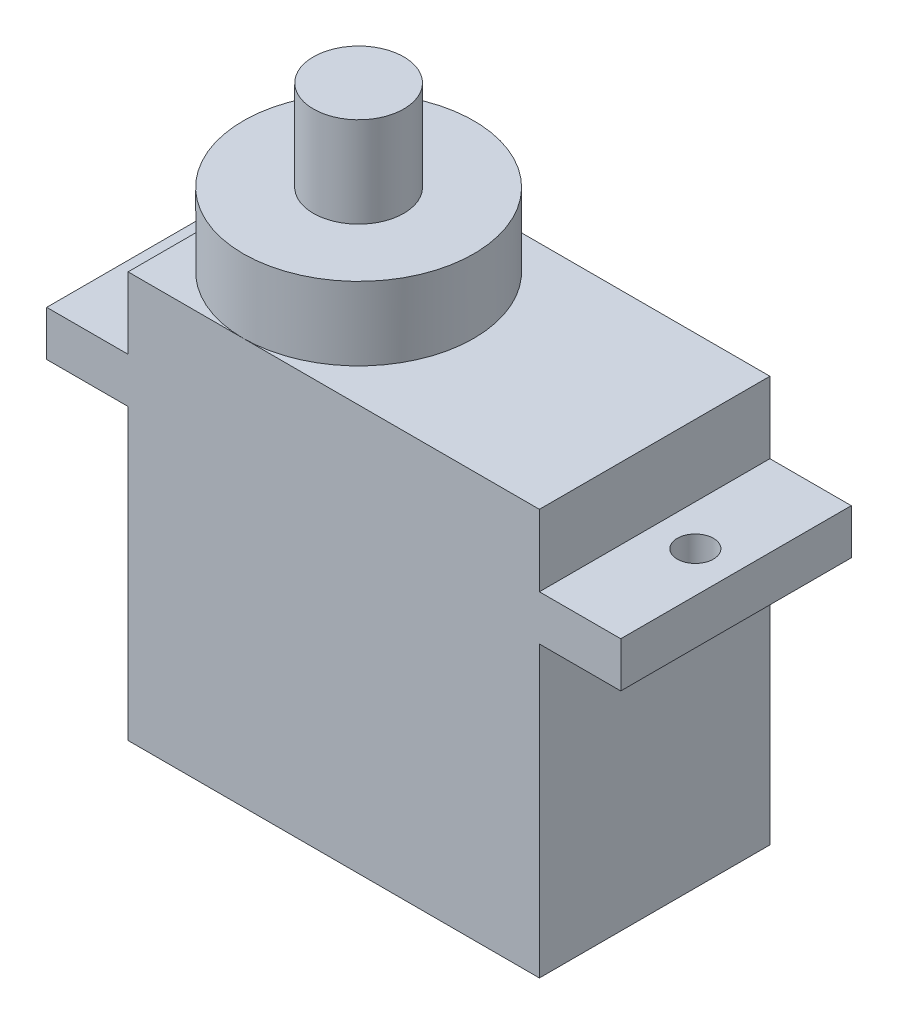
ISO-10303-21;
HEADER;
FILE_DESCRIPTION(('STEP AP214'),'2;1');
FILE_NAME('part.step','',(''),(''),'','','');
FILE_SCHEMA(('AUTOMOTIVE_DESIGN { 1 0 10303 214 1 1 1 1 }'));
ENDSEC;
DATA;
#1=APPLICATION_CONTEXT('core data for automotive mechanical design processes');
#2=APPLICATION_PROTOCOL_DEFINITION('international standard','automotive_design',2000,#1);
#3=PRODUCT_CONTEXT('',#1,'mechanical');
#4=PRODUCT('Part','Part','',(#3));
#5=PRODUCT_RELATED_PRODUCT_CATEGORY('part','',(#4));
#6=PRODUCT_DEFINITION_FORMATION('','',#4);
#7=PRODUCT_DEFINITION_CONTEXT('part definition',#1,'design');
#8=PRODUCT_DEFINITION('design','',#6,#7);
#9=PRODUCT_DEFINITION_SHAPE('','',#8);
#10=(LENGTH_UNIT() NAMED_UNIT(*) SI_UNIT(.MILLI.,.METRE.));
#11=(NAMED_UNIT(*) PLANE_ANGLE_UNIT() SI_UNIT($,.RADIAN.));
#12=(NAMED_UNIT(*) SI_UNIT($,.STERADIAN.) SOLID_ANGLE_UNIT());
#13=UNCERTAINTY_MEASURE_WITH_UNIT(LENGTH_MEASURE(1.E-05),#10,'distance_accuracy_value','');
#14=(GEOMETRIC_REPRESENTATION_CONTEXT(3) GLOBAL_UNCERTAINTY_ASSIGNED_CONTEXT((#13)) GLOBAL_UNIT_ASSIGNED_CONTEXT((#10,
#11,#12)) REPRESENTATION_CONTEXT('',''));
#15=CARTESIAN_POINT('',(0.,0.,0.));
#16=DIRECTION('',(0.,0.,1.));
#17=DIRECTION('',(1.,0.,0.));
#18=AXIS2_PLACEMENT_3D('',#15,#16,#17);
#19=CARTESIAN_POINT('',(-7.89586466165413,11.225,12.75));
#20=DIRECTION('',(0.,-1.,0.));
#21=DIRECTION('',(0.,0.,-1.));
#22=AXIS2_PLACEMENT_3D('',#19,#20,#21);
#23=PLANE('',#22);
#24=CARTESIAN_POINT('',(-1.52086466165413,11.225,6.375));
#25=DIRECTION('',(0.,1.,0.));
#26=DIRECTION('',(0.,0.,1.));
#27=AXIS2_PLACEMENT_3D('',#24,#25,#26);
#28=CIRCLE('',#27,6.375);
#29=CARTESIAN_POINT('',(-1.52086466165413,11.225,12.75));
#30=VERTEX_POINT('',#29);
#31=CARTESIAN_POINT('',(-1.52086466165413,11.225,0.));
#32=VERTEX_POINT('',#31);
#33=EDGE_CURVE('E154',#30,#32,#28,.T.);
#34=ORIENTED_EDGE('',*,*,#33,.F.);
#35=DIRECTION('',(-1.,0.,0.));
#36=VECTOR('',#35,1.);
#37=CARTESIAN_POINT('',(-7.89586466165413,11.225,12.75));
#38=LINE('',#37,#36);
#39=CARTESIAN_POINT('',(14.8541353383459,11.225,12.75));
#40=VERTEX_POINT('',#39);
#41=EDGE_CURVE('E134',#40,#30,#38,.T.);
#42=ORIENTED_EDGE('',*,*,#41,.F.);
#43=DIRECTION('',(0.,0.,-1.));
#44=VECTOR('',#43,1.);
#45=CARTESIAN_POINT('',(14.8541353383459,11.225,12.75));
#46=LINE('',#45,#44);
#47=CARTESIAN_POINT('',(14.8541353383459,11.225,0.));
#48=VERTEX_POINT('',#47);
#49=EDGE_CURVE('E37',#40,#48,#46,.T.);
#50=ORIENTED_EDGE('',*,*,#49,.T.);
#51=DIRECTION('',(-1.,0.,0.));
#52=VECTOR('',#51,1.);
#53=CARTESIAN_POINT('',(-7.89586466165413,11.225,0.));
#54=LINE('',#53,#52);
#55=EDGE_CURVE('E156',#48,#32,#54,.T.);
#56=ORIENTED_EDGE('',*,*,#55,.T.);
#57=EDGE_LOOP('',(#34,#42,#50,#56));
#58=FACE_BOUND('',#57,.T.);
#59=ADVANCED_FACE('F33',(#58),#23,.F.);
#60=CARTESIAN_POINT('',(-7.89586466165413,11.225,6.375));
#61=VERTEX_POINT('',#60);
#62=EDGE_CURVE('E42',#32,#61,#28,.T.);
#63=ORIENTED_EDGE('',*,*,#62,.F.);
#64=CARTESIAN_POINT('',(-7.89586466165413,11.225,0.));
#65=VERTEX_POINT('',#64);
#66=EDGE_CURVE('E238',#32,#65,#54,.T.);
#67=ORIENTED_EDGE('',*,*,#66,.T.);
#68=DIRECTION('',(0.,0.,-1.));
#69=VECTOR('',#68,1.);
#70=CARTESIAN_POINT('',(-7.89586466165413,11.225,12.75));
#71=LINE('',#70,#69);
#72=EDGE_CURVE('E249',#61,#65,#71,.T.);
#73=ORIENTED_EDGE('',*,*,#72,.F.);
#74=EDGE_LOOP('',(#63,#67,#73));
#75=FACE_BOUND('',#74,.T.);
#76=ADVANCED_FACE('F253',(#75),#23,.F.);
#77=CARTESIAN_POINT('',(-7.89586466165413,-11.225,12.75));
#78=DIRECTION('',(1.,0.,0.));
#79=DIRECTION('',(0.,0.,-1.));
#80=AXIS2_PLACEMENT_3D('',#77,#78,#79);
#81=PLANE('',#80);
#82=DIRECTION('',(0.,0.,-1.));
#83=VECTOR('',#82,1.);
#84=CARTESIAN_POINT('',(-7.89586466165413,7.275,0.));
#85=LINE('',#84,#83);
#86=CARTESIAN_POINT('',(-7.89586466165413,7.275,12.75));
#87=VERTEX_POINT('',#86);
#88=CARTESIAN_POINT('',(-7.89586466165413,7.275,0.));
#89=VERTEX_POINT('',#88);
#90=EDGE_CURVE('E181',#87,#89,#85,.T.);
#91=ORIENTED_EDGE('',*,*,#90,.F.);
#92=DIRECTION('',(0.,-1.,0.));
#93=VECTOR('',#92,1.);
#94=CARTESIAN_POINT('',(-7.89586466165413,-11.225,12.75));
#95=LINE('',#94,#93);
#96=CARTESIAN_POINT('',(-7.89586466165413,11.225,12.75));
#97=VERTEX_POINT('',#96);
#98=EDGE_CURVE('E231',#97,#87,#95,.T.);
#99=ORIENTED_EDGE('',*,*,#98,.F.);
#100=EDGE_CURVE('E149',#97,#61,#71,.T.);
#101=ORIENTED_EDGE('',*,*,#100,.T.);
#102=ORIENTED_EDGE('',*,*,#72,.T.);
#103=DIRECTION('',(0.,-1.,0.));
#104=VECTOR('',#103,1.);
#105=CARTESIAN_POINT('',(-7.89586466165413,-11.225,0.));
#106=LINE('',#105,#104);
#107=EDGE_CURVE('E241',#65,#89,#106,.T.);
#108=ORIENTED_EDGE('',*,*,#107,.T.);
#109=EDGE_LOOP('',(#91,#99,#101,#102,#108));
#110=FACE_BOUND('',#109,.T.);
#111=ADVANCED_FACE('F251',(#110),#81,.F.);
#112=DIRECTION('',(0.,0.,1.));
#113=VECTOR('',#112,1.);
#114=CARTESIAN_POINT('',(-7.89586466165413,4.775,0.));
#115=LINE('',#114,#113);
#116=CARTESIAN_POINT('',(-7.89586466165413,4.775,0.));
#117=VERTEX_POINT('',#116);
#118=CARTESIAN_POINT('',(-7.89586466165413,4.775,12.75));
#119=VERTEX_POINT('',#118);
#120=EDGE_CURVE('E174',#117,#119,#115,.T.);
#121=ORIENTED_EDGE('',*,*,#120,.F.);
#122=CARTESIAN_POINT('',(-7.89586466165413,-11.225,0.));
#123=VERTEX_POINT('',#122);
#124=EDGE_CURVE('E240',#117,#123,#106,.T.);
#125=ORIENTED_EDGE('',*,*,#124,.T.);
#126=DIRECTION('',(0.,0.,-1.));
#127=VECTOR('',#126,1.);
#128=CARTESIAN_POINT('',(-7.89586466165413,-11.225,12.75));
#129=LINE('',#128,#127);
#130=CARTESIAN_POINT('',(-7.89586466165413,-11.225,12.75));
#131=VERTEX_POINT('',#130);
#132=EDGE_CURVE('E247',#131,#123,#129,.T.);
#133=ORIENTED_EDGE('',*,*,#132,.F.);
#134=EDGE_CURVE('E145',#119,#131,#95,.T.);
#135=ORIENTED_EDGE('',*,*,#134,.F.);
#136=EDGE_LOOP('',(#121,#125,#133,#135));
#137=FACE_BOUND('',#136,.T.);
#138=ADVANCED_FACE('F272',(#137),#81,.F.);
#139=CARTESIAN_POINT('',(14.8541353383459,-11.225,12.75));
#140=DIRECTION('',(-1.,0.,0.));
#141=DIRECTION('',(0.,0.,1.));
#142=AXIS2_PLACEMENT_3D('',#139,#140,#141);
#143=PLANE('',#142);
#144=DIRECTION('',(0.,0.,1.));
#145=VECTOR('',#144,1.);
#146=CARTESIAN_POINT('',(14.8541353383459,7.275,12.75));
#147=LINE('',#146,#145);
#148=CARTESIAN_POINT('',(14.8541353383459,7.275,0.));
#149=VERTEX_POINT('',#148);
#150=CARTESIAN_POINT('',(14.8541353383459,7.275,12.75));
#151=VERTEX_POINT('',#150);
#152=EDGE_CURVE('E208',#149,#151,#147,.T.);
#153=ORIENTED_EDGE('',*,*,#152,.F.);
#154=DIRECTION('',(0.,1.,0.));
#155=VECTOR('',#154,1.);
#156=CARTESIAN_POINT('',(14.8541353383459,-11.225,0.));
#157=LINE('',#156,#155);
#158=EDGE_CURVE('E229',#149,#48,#157,.T.);
#159=ORIENTED_EDGE('',*,*,#158,.T.);
#160=ORIENTED_EDGE('',*,*,#49,.F.);
#161=DIRECTION('',(0.,1.,0.));
#162=VECTOR('',#161,1.);
#163=CARTESIAN_POINT('',(14.8541353383459,-11.225,12.75));
#164=LINE('',#163,#162);
#165=EDGE_CURVE('E140',#151,#40,#164,.T.);
#166=ORIENTED_EDGE('',*,*,#165,.F.);
#167=EDGE_LOOP('',(#153,#159,#160,#166));
#168=FACE_BOUND('',#167,.T.);
#169=ADVANCED_FACE('F35',(#168),#143,.F.);
#170=DIRECTION('',(0.,0.,-1.));
#171=VECTOR('',#170,1.);
#172=CARTESIAN_POINT('',(14.8541353383459,4.775,12.75));
#173=LINE('',#172,#171);
#174=CARTESIAN_POINT('',(14.8541353383459,4.775,12.75));
#175=VERTEX_POINT('',#174);
#176=CARTESIAN_POINT('',(14.8541353383459,4.775,0.));
#177=VERTEX_POINT('',#176);
#178=EDGE_CURVE('E203',#175,#177,#173,.T.);
#179=ORIENTED_EDGE('',*,*,#178,.F.);
#180=CARTESIAN_POINT('',(14.8541353383459,-11.225,12.75));
#181=VERTEX_POINT('',#180);
#182=EDGE_CURVE('E151',#181,#175,#164,.T.);
#183=ORIENTED_EDGE('',*,*,#182,.F.);
#184=DIRECTION('',(0.,0.,-1.));
#185=VECTOR('',#184,1.);
#186=CARTESIAN_POINT('',(14.8541353383459,-11.225,12.75));
#187=LINE('',#186,#185);
#188=CARTESIAN_POINT('',(14.8541353383459,-11.225,0.));
#189=VERTEX_POINT('',#188);
#190=EDGE_CURVE('E235',#181,#189,#187,.T.);
#191=ORIENTED_EDGE('',*,*,#190,.T.);
#192=EDGE_CURVE('E236',#189,#177,#157,.T.);
#193=ORIENTED_EDGE('',*,*,#192,.T.);
#194=EDGE_LOOP('',(#179,#183,#191,#193));
#195=FACE_BOUND('',#194,.T.);
#196=ADVANCED_FACE('F281',(#195),#143,.F.);
#197=EDGE_CURVE('E50',#61,#30,#28,.T.);
#198=ORIENTED_EDGE('',*,*,#197,.F.);
#199=ORIENTED_EDGE('',*,*,#100,.F.);
#200=EDGE_CURVE('E138',#30,#97,#38,.T.);
#201=ORIENTED_EDGE('',*,*,#200,.F.);
#202=EDGE_LOOP('',(#198,#199,#201));
#203=FACE_BOUND('',#202,.T.);
#204=ADVANCED_FACE('F147',(#203),#23,.F.);
#205=CARTESIAN_POINT('',(-7.89586466165413,-11.225,12.75));
#206=DIRECTION('',(0.,1.,0.));
#207=DIRECTION('',(0.,0.,1.));
#208=AXIS2_PLACEMENT_3D('',#205,#206,#207);
#209=PLANE('',#208);
#210=DIRECTION('',(1.,0.,0.));
#211=VECTOR('',#210,1.);
#212=CARTESIAN_POINT('',(-7.89586466165413,-11.225,0.));
#213=LINE('',#212,#211);
#214=EDGE_CURVE('E243',#123,#189,#213,.T.);
#215=ORIENTED_EDGE('',*,*,#214,.T.);
#216=ORIENTED_EDGE('',*,*,#190,.F.);
#217=DIRECTION('',(1.,0.,0.));
#218=VECTOR('',#217,1.);
#219=CARTESIAN_POINT('',(-7.89586466165413,-11.225,12.75));
#220=LINE('',#219,#218);
#221=EDGE_CURVE('E233',#131,#181,#220,.T.);
#222=ORIENTED_EDGE('',*,*,#221,.F.);
#223=ORIENTED_EDGE('',*,*,#132,.T.);
#224=EDGE_LOOP('',(#215,#216,#222,#223));
#225=FACE_BOUND('',#224,.T.);
#226=ADVANCED_FACE('F277',(#225),#209,.F.);
#227=CARTESIAN_POINT('',(0.,0.,12.75));
#228=DIRECTION('',(0.,0.,-1.));
#229=DIRECTION('',(-1.,0.,0.));
#230=AXIS2_PLACEMENT_3D('',#227,#228,#229);
#231=PLANE('',#230);
#232=ORIENTED_EDGE('',*,*,#182,.T.);
#233=DIRECTION('',(-1.,0.,0.));
#234=VECTOR('',#233,1.);
#235=CARTESIAN_POINT('',(19.3541353383459,4.775,12.75));
#236=LINE('',#235,#234);
#237=CARTESIAN_POINT('',(19.3541353383459,4.775,12.75));
#238=VERTEX_POINT('',#237);
#239=EDGE_CURVE('E226',#238,#175,#236,.T.);
#240=ORIENTED_EDGE('',*,*,#239,.F.);
#241=DIRECTION('',(0.,-1.,0.));
#242=VECTOR('',#241,1.);
#243=CARTESIAN_POINT('',(19.3541353383459,7.275,12.75));
#244=LINE('',#243,#242);
#245=CARTESIAN_POINT('',(19.3541353383459,7.275,12.75));
#246=VERTEX_POINT('',#245);
#247=EDGE_CURVE('E204',#246,#238,#244,.T.);
#248=ORIENTED_EDGE('',*,*,#247,.F.);
#249=DIRECTION('',(-1.,0.,0.));
#250=VECTOR('',#249,1.);
#251=CARTESIAN_POINT('',(19.3541353383459,7.275,12.75));
#252=LINE('',#251,#250);
#253=EDGE_CURVE('E214',#246,#151,#252,.T.);
#254=ORIENTED_EDGE('',*,*,#253,.T.);
#255=ORIENTED_EDGE('',*,*,#165,.T.);
#256=ORIENTED_EDGE('',*,*,#41,.T.);
#257=ORIENTED_EDGE('',*,*,#200,.T.);
#258=ORIENTED_EDGE('',*,*,#98,.T.);
#259=DIRECTION('',(1.,0.,0.));
#260=VECTOR('',#259,1.);
#261=CARTESIAN_POINT('',(-12.3958646616541,7.275,12.75));
#262=LINE('',#261,#260);
#263=CARTESIAN_POINT('',(-12.3958646616541,7.275,12.75));
#264=VERTEX_POINT('',#263);
#265=EDGE_CURVE('E194',#264,#87,#262,.T.);
#266=ORIENTED_EDGE('',*,*,#265,.F.);
#267=DIRECTION('',(0.,1.,0.));
#268=VECTOR('',#267,1.);
#269=CARTESIAN_POINT('',(-12.3958646616541,7.275,12.75));
#270=LINE('',#269,#268);
#271=CARTESIAN_POINT('',(-12.3958646616541,4.775,12.75));
#272=VERTEX_POINT('',#271);
#273=EDGE_CURVE('E183',#272,#264,#270,.T.);
#274=ORIENTED_EDGE('',*,*,#273,.F.);
#275=DIRECTION('',(1.,0.,0.));
#276=VECTOR('',#275,1.);
#277=CARTESIAN_POINT('',(-12.3958646616541,4.775,12.75));
#278=LINE('',#277,#276);
#279=EDGE_CURVE('E197',#272,#119,#278,.T.);
#280=ORIENTED_EDGE('',*,*,#279,.T.);
#281=ORIENTED_EDGE('',*,*,#134,.T.);
#282=ORIENTED_EDGE('',*,*,#221,.T.);
#283=EDGE_LOOP('',(#232,#240,#248,#254,#255,#256,#257,#258,#266,#274,#280,#281,#282));
#284=FACE_BOUND('',#283,.T.);
#285=ADVANCED_FACE('F136',(#284),#231,.F.);
#286=CARTESIAN_POINT('',(0.,0.,0.));
#287=DIRECTION('',(0.,0.,-1.));
#288=DIRECTION('',(-1.,0.,0.));
#289=AXIS2_PLACEMENT_3D('',#286,#287,#288);
#290=PLANE('',#289);
#291=ORIENTED_EDGE('',*,*,#192,.F.);
#292=ORIENTED_EDGE('',*,*,#214,.F.);
#293=ORIENTED_EDGE('',*,*,#124,.F.);
#294=DIRECTION('',(1.,0.,0.));
#295=VECTOR('',#294,1.);
#296=CARTESIAN_POINT('',(-12.3958646616541,4.775,0.));
#297=LINE('',#296,#295);
#298=CARTESIAN_POINT('',(-12.3958646616541,4.775,0.));
#299=VERTEX_POINT('',#298);
#300=EDGE_CURVE('E200',#299,#117,#297,.T.);
#301=ORIENTED_EDGE('',*,*,#300,.F.);
#302=DIRECTION('',(0.,-1.,0.));
#303=VECTOR('',#302,1.);
#304=CARTESIAN_POINT('',(-12.3958646616541,7.275,0.));
#305=LINE('',#304,#303);
#306=CARTESIAN_POINT('',(-12.3958646616541,7.275,0.));
#307=VERTEX_POINT('',#306);
#308=EDGE_CURVE('E177',#307,#299,#305,.T.);
#309=ORIENTED_EDGE('',*,*,#308,.F.);
#310=DIRECTION('',(1.,0.,0.));
#311=VECTOR('',#310,1.);
#312=CARTESIAN_POINT('',(-12.3958646616541,7.275,0.));
#313=LINE('',#312,#311);
#314=EDGE_CURVE('E187',#307,#89,#313,.T.);
#315=ORIENTED_EDGE('',*,*,#314,.T.);
#316=ORIENTED_EDGE('',*,*,#107,.F.);
#317=ORIENTED_EDGE('',*,*,#66,.F.);
#318=ORIENTED_EDGE('',*,*,#55,.F.);
#319=ORIENTED_EDGE('',*,*,#158,.F.);
#320=DIRECTION('',(-1.,0.,0.));
#321=VECTOR('',#320,1.);
#322=CARTESIAN_POINT('',(19.3541353383459,7.275,0.));
#323=LINE('',#322,#321);
#324=CARTESIAN_POINT('',(19.3541353383459,7.275,0.));
#325=VERTEX_POINT('',#324);
#326=EDGE_CURVE('E220',#325,#149,#323,.T.);
#327=ORIENTED_EDGE('',*,*,#326,.F.);
#328=DIRECTION('',(0.,1.,0.));
#329=VECTOR('',#328,1.);
#330=CARTESIAN_POINT('',(19.3541353383459,7.275,0.));
#331=LINE('',#330,#329);
#332=CARTESIAN_POINT('',(19.3541353383459,4.775,0.));
#333=VERTEX_POINT('',#332);
#334=EDGE_CURVE('E210',#333,#325,#331,.T.);
#335=ORIENTED_EDGE('',*,*,#334,.F.);
#336=DIRECTION('',(-1.,0.,0.));
#337=VECTOR('',#336,1.);
#338=CARTESIAN_POINT('',(19.3541353383459,4.775,0.));
#339=LINE('',#338,#337);
#340=EDGE_CURVE('E223',#333,#177,#339,.T.);
#341=ORIENTED_EDGE('',*,*,#340,.T.);
#342=EDGE_LOOP('',(#291,#292,#293,#301,#309,#315,#316,#317,#318,#319,#327,#335,#341));
#343=FACE_BOUND('',#342,.T.);
#344=ADVANCED_FACE('F256',(#343),#290,.T.);
#345=CARTESIAN_POINT('',(19.3541353383459,4.775,12.75));
#346=DIRECTION('',(0.,1.,0.));
#347=DIRECTION('',(0.,0.,1.));
#348=AXIS2_PLACEMENT_3D('',#345,#346,#347);
#349=PLANE('',#348);
#350=CARTESIAN_POINT('',(17.1041353383459,4.775,6.375));
#351=DIRECTION('',(0.,1.,0.));
#352=DIRECTION('',(0.,0.,1.));
#353=AXIS2_PLACEMENT_3D('',#350,#351,#352);
#354=CIRCLE('',#353,1.);
#355=CARTESIAN_POINT('',(17.1041353383459,4.775,7.375));
#356=VERTEX_POINT('',#355);
#357=EDGE_CURVE('E164',#356,#356,#354,.T.);
#358=ORIENTED_EDGE('',*,*,#357,.T.);
#359=EDGE_LOOP('',(#358));
#360=FACE_BOUND('',#359,.T.);
#361=ORIENTED_EDGE('',*,*,#178,.T.);
#362=ORIENTED_EDGE('',*,*,#340,.F.);
#363=DIRECTION('',(0.,0.,-1.));
#364=VECTOR('',#363,1.);
#365=CARTESIAN_POINT('',(19.3541353383459,4.775,12.75));
#366=LINE('',#365,#364);
#367=EDGE_CURVE('E207',#238,#333,#366,.T.);
#368=ORIENTED_EDGE('',*,*,#367,.F.);
#369=ORIENTED_EDGE('',*,*,#239,.T.);
#370=EDGE_LOOP('',(#361,#362,#368,#369));
#371=FACE_BOUND('',#370,.T.);
#372=ADVANCED_FACE('F285',(#360,#371),#349,.F.);
#373=CARTESIAN_POINT('',(19.3541353383459,7.275,12.75));
#374=DIRECTION('',(0.,-1.,0.));
#375=DIRECTION('',(0.,0.,-1.));
#376=AXIS2_PLACEMENT_3D('',#373,#374,#375);
#377=PLANE('',#376);
#378=CARTESIAN_POINT('',(17.1041353383459,7.275,6.375));
#379=DIRECTION('',(0.,1.,0.));
#380=DIRECTION('',(0.,0.,1.));
#381=AXIS2_PLACEMENT_3D('',#378,#379,#380);
#382=CIRCLE('',#381,1.);
#383=CARTESIAN_POINT('',(17.1041353383459,7.275,7.375));
#384=VERTEX_POINT('',#383);
#385=EDGE_CURVE('E168',#384,#384,#382,.T.);
#386=ORIENTED_EDGE('',*,*,#385,.F.);
#387=EDGE_LOOP('',(#386));
#388=FACE_BOUND('',#387,.T.);
#389=ORIENTED_EDGE('',*,*,#152,.T.);
#390=ORIENTED_EDGE('',*,*,#253,.F.);
#391=DIRECTION('',(0.,0.,1.));
#392=VECTOR('',#391,1.);
#393=CARTESIAN_POINT('',(19.3541353383459,7.275,12.75));
#394=LINE('',#393,#392);
#395=EDGE_CURVE('E212',#325,#246,#394,.T.);
#396=ORIENTED_EDGE('',*,*,#395,.F.);
#397=ORIENTED_EDGE('',*,*,#326,.T.);
#398=EDGE_LOOP('',(#389,#390,#396,#397));
#399=FACE_BOUND('',#398,.T.);
#400=ADVANCED_FACE('F293',(#388,#399),#377,.F.);
#401=CARTESIAN_POINT('',(19.3541353383459,0.,0.));
#402=DIRECTION('',(1.,0.,0.));
#403=DIRECTION('',(0.,0.,-1.));
#404=AXIS2_PLACEMENT_3D('',#401,#402,#403);
#405=PLANE('',#404);
#406=ORIENTED_EDGE('',*,*,#247,.T.);
#407=ORIENTED_EDGE('',*,*,#367,.T.);
#408=ORIENTED_EDGE('',*,*,#334,.T.);
#409=ORIENTED_EDGE('',*,*,#395,.T.);
#410=EDGE_LOOP('',(#406,#407,#408,#409));
#411=FACE_BOUND('',#410,.T.);
#412=ADVANCED_FACE('F289',(#411),#405,.T.);
#413=CARTESIAN_POINT('',(-12.3958646616541,4.775,0.));
#414=DIRECTION('',(0.,1.,0.));
#415=DIRECTION('',(0.,0.,1.));
#416=AXIS2_PLACEMENT_3D('',#413,#414,#415);
#417=PLANE('',#416);
#418=CARTESIAN_POINT('',(-10.1458646616541,4.775,6.375));
#419=DIRECTION('',(0.,1.,0.));
#420=DIRECTION('',(0.,0.,1.));
#421=AXIS2_PLACEMENT_3D('',#418,#419,#420);
#422=CIRCLE('',#421,1.);
#423=CARTESIAN_POINT('',(-10.1458646616541,4.775,7.375));
#424=VERTEX_POINT('',#423);
#425=EDGE_CURVE('E171',#424,#424,#422,.T.);
#426=ORIENTED_EDGE('',*,*,#425,.T.);
#427=EDGE_LOOP('',(#426));
#428=FACE_BOUND('',#427,.T.);
#429=ORIENTED_EDGE('',*,*,#120,.T.);
#430=ORIENTED_EDGE('',*,*,#279,.F.);
#431=DIRECTION('',(0.,0.,1.));
#432=VECTOR('',#431,1.);
#433=CARTESIAN_POINT('',(-12.3958646616541,4.775,0.));
#434=LINE('',#433,#432);
#435=EDGE_CURVE('E180',#299,#272,#434,.T.);
#436=ORIENTED_EDGE('',*,*,#435,.F.);
#437=ORIENTED_EDGE('',*,*,#300,.T.);
#438=EDGE_LOOP('',(#429,#430,#436,#437));
#439=FACE_BOUND('',#438,.T.);
#440=ADVANCED_FACE('F269',(#428,#439),#417,.F.);
#441=CARTESIAN_POINT('',(-12.3958646616541,7.275,0.));
#442=DIRECTION('',(0.,-1.,0.));
#443=DIRECTION('',(0.,0.,-1.));
#444=AXIS2_PLACEMENT_3D('',#441,#442,#443);
#445=PLANE('',#444);
#446=CARTESIAN_POINT('',(-10.1458646616541,7.275,6.375));
#447=DIRECTION('',(0.,1.,0.));
#448=DIRECTION('',(0.,0.,1.));
#449=AXIS2_PLACEMENT_3D('',#446,#447,#448);
#450=CIRCLE('',#449,1.);
#451=CARTESIAN_POINT('',(-10.1458646616541,7.275,7.375));
#452=VERTEX_POINT('',#451);
#453=EDGE_CURVE('E167',#452,#452,#450,.T.);
#454=ORIENTED_EDGE('',*,*,#453,.F.);
#455=EDGE_LOOP('',(#454));
#456=FACE_BOUND('',#455,.T.);
#457=ORIENTED_EDGE('',*,*,#90,.T.);
#458=ORIENTED_EDGE('',*,*,#314,.F.);
#459=DIRECTION('',(0.,0.,-1.));
#460=VECTOR('',#459,1.);
#461=CARTESIAN_POINT('',(-12.3958646616541,7.275,0.));
#462=LINE('',#461,#460);
#463=EDGE_CURVE('E185',#264,#307,#462,.T.);
#464=ORIENTED_EDGE('',*,*,#463,.F.);
#465=ORIENTED_EDGE('',*,*,#265,.T.);
#466=EDGE_LOOP('',(#457,#458,#464,#465));
#467=FACE_BOUND('',#466,.T.);
#468=ADVANCED_FACE('F262',(#456,#467),#445,.F.);
#469=CARTESIAN_POINT('',(-12.3958646616541,0.,0.));
#470=DIRECTION('',(-1.,0.,0.));
#471=DIRECTION('',(0.,0.,1.));
#472=AXIS2_PLACEMENT_3D('',#469,#470,#471);
#473=PLANE('',#472);
#474=ORIENTED_EDGE('',*,*,#308,.T.);
#475=ORIENTED_EDGE('',*,*,#435,.T.);
#476=ORIENTED_EDGE('',*,*,#273,.T.);
#477=ORIENTED_EDGE('',*,*,#463,.T.);
#478=EDGE_LOOP('',(#474,#475,#476,#477));
#479=FACE_BOUND('',#478,.T.);
#480=ADVANCED_FACE('F267',(#479),#473,.T.);
#481=CARTESIAN_POINT('',(-10.1458646616541,4.775,6.375));
#482=DIRECTION('',(0.,1.,0.));
#483=DIRECTION('',(0.,0.,1.));
#484=AXIS2_PLACEMENT_3D('',#481,#482,#483);
#485=CYLINDRICAL_SURFACE('',#484,1.);
#486=ORIENTED_EDGE('',*,*,#425,.F.);
#487=EDGE_LOOP('',(#486));
#488=FACE_BOUND('',#487,.T.);
#489=ORIENTED_EDGE('',*,*,#453,.T.);
#490=EDGE_LOOP('',(#489));
#491=FACE_BOUND('',#490,.T.);
#492=ADVANCED_FACE('F340',(#488,#491),#485,.F.);
#493=CARTESIAN_POINT('',(17.1041353383459,4.775,6.375));
#494=DIRECTION('',(0.,1.,0.));
#495=DIRECTION('',(0.,0.,1.));
#496=AXIS2_PLACEMENT_3D('',#493,#494,#495);
#497=CYLINDRICAL_SURFACE('',#496,1.);
#498=ORIENTED_EDGE('',*,*,#357,.F.);
#499=EDGE_LOOP('',(#498));
#500=FACE_BOUND('',#499,.T.);
#501=ORIENTED_EDGE('',*,*,#385,.T.);
#502=EDGE_LOOP('',(#501));
#503=FACE_BOUND('',#502,.T.);
#504=ADVANCED_FACE('F368',(#500,#503),#497,.F.);
#505=CARTESIAN_POINT('',(-1.52086466165413,15.275,6.375));
#506=DIRECTION('',(0.,-1.,0.));
#507=DIRECTION('',(0.,0.,-1.));
#508=AXIS2_PLACEMENT_3D('',#505,#506,#507);
#509=CYLINDRICAL_SURFACE('',#508,6.375);
#510=CARTESIAN_POINT('',(-1.52086466165413,15.275,6.375));
#511=DIRECTION('',(0.,1.,0.));
#512=DIRECTION('',(0.,0.,1.));
#513=AXIS2_PLACEMENT_3D('',#510,#511,#512);
#514=CIRCLE('',#513,6.375);
#515=CARTESIAN_POINT('',(-1.52086466165413,15.275,12.75));
#516=VERTEX_POINT('',#515);
#517=EDGE_CURVE('E158',#516,#516,#514,.T.);
#518=ORIENTED_EDGE('',*,*,#517,.F.);
#519=EDGE_LOOP('',(#518));
#520=FACE_BOUND('',#519,.T.);
#521=ORIENTED_EDGE('',*,*,#33,.T.);
#522=ORIENTED_EDGE('',*,*,#62,.T.);
#523=ORIENTED_EDGE('',*,*,#197,.T.);
#524=EDGE_LOOP('',(#521,#522,#523));
#525=FACE_BOUND('',#524,.T.);
#526=ADVANCED_FACE('F161',(#520,#525),#509,.T.);
#527=CARTESIAN_POINT('',(-1.52086466165413,15.275,6.375));
#528=DIRECTION('',(0.,1.,0.));
#529=DIRECTION('',(0.,0.,1.));
#530=AXIS2_PLACEMENT_3D('',#527,#528,#529);
#531=PLANE('',#530);
#532=CARTESIAN_POINT('',(-1.52086466165413,15.275,6.375));
#533=DIRECTION('',(0.,1.,0.));
#534=DIRECTION('',(0.,0.,1.));
#535=AXIS2_PLACEMENT_3D('',#532,#533,#534);
#536=CIRCLE('',#535,2.5);
#537=CARTESIAN_POINT('',(-1.52086466165413,15.275,8.875));
#538=VERTEX_POINT('',#537);
#539=EDGE_CURVE('E11',#538,#538,#536,.T.);
#540=ORIENTED_EDGE('',*,*,#539,.F.);
#541=EDGE_LOOP('',(#540));
#542=FACE_BOUND('',#541,.T.);
#543=ORIENTED_EDGE('',*,*,#517,.T.);
#544=EDGE_LOOP('',(#543));
#545=FACE_BOUND('',#544,.T.);
#546=ADVANCED_FACE('F416',(#542,#545),#531,.T.);
#547=CARTESIAN_POINT('',(-1.52086466165413,20.275,6.375));
#548=DIRECTION('',(0.,-1.,0.));
#549=DIRECTION('',(0.,0.,-1.));
#550=AXIS2_PLACEMENT_3D('',#547,#548,#549);
#551=CYLINDRICAL_SURFACE('',#550,2.5);
#552=CARTESIAN_POINT('',(-1.52086466165413,20.275,6.375));
#553=DIRECTION('',(0.,1.,0.));
#554=DIRECTION('',(0.,0.,1.));
#555=AXIS2_PLACEMENT_3D('',#552,#553,#554);
#556=CIRCLE('',#555,2.5);
#557=CARTESIAN_POINT('',(-1.52086466165413,20.275,8.875));
#558=VERTEX_POINT('',#557);
#559=EDGE_CURVE('E159',#558,#558,#556,.T.);
#560=ORIENTED_EDGE('',*,*,#559,.F.);
#561=EDGE_LOOP('',(#560));
#562=FACE_BOUND('',#561,.T.);
#563=ORIENTED_EDGE('',*,*,#539,.T.);
#564=EDGE_LOOP('',(#563));
#565=FACE_BOUND('',#564,.T.);
#566=ADVANCED_FACE('F426',(#562,#565),#551,.T.);
#567=CARTESIAN_POINT('',(-1.52086466165413,20.275,6.375));
#568=DIRECTION('',(0.,1.,0.));
#569=DIRECTION('',(0.,0.,1.));
#570=AXIS2_PLACEMENT_3D('',#567,#568,#569);
#571=PLANE('',#570);
#572=ORIENTED_EDGE('',*,*,#559,.T.);
#573=EDGE_LOOP('',(#572));
#574=FACE_BOUND('',#573,.T.);
#575=ADVANCED_FACE('F435',(#574),#571,.T.);
#576=CLOSED_SHELL('',(#59,#76,#111,#138,#169,#196,#204,#226,#285,#344,#372,#400,#412,#440,#468,
#480,#492,#504,#526,#546,#566,#575));
#577=MANIFOLD_SOLID_BREP('B2',#576);
#578=ADVANCED_BREP_SHAPE_REPRESENTATION('',(#18,#577),#14);
#579=SHAPE_DEFINITION_REPRESENTATION(#9,#578);
ENDSEC;
END-ISO-10303-21;
